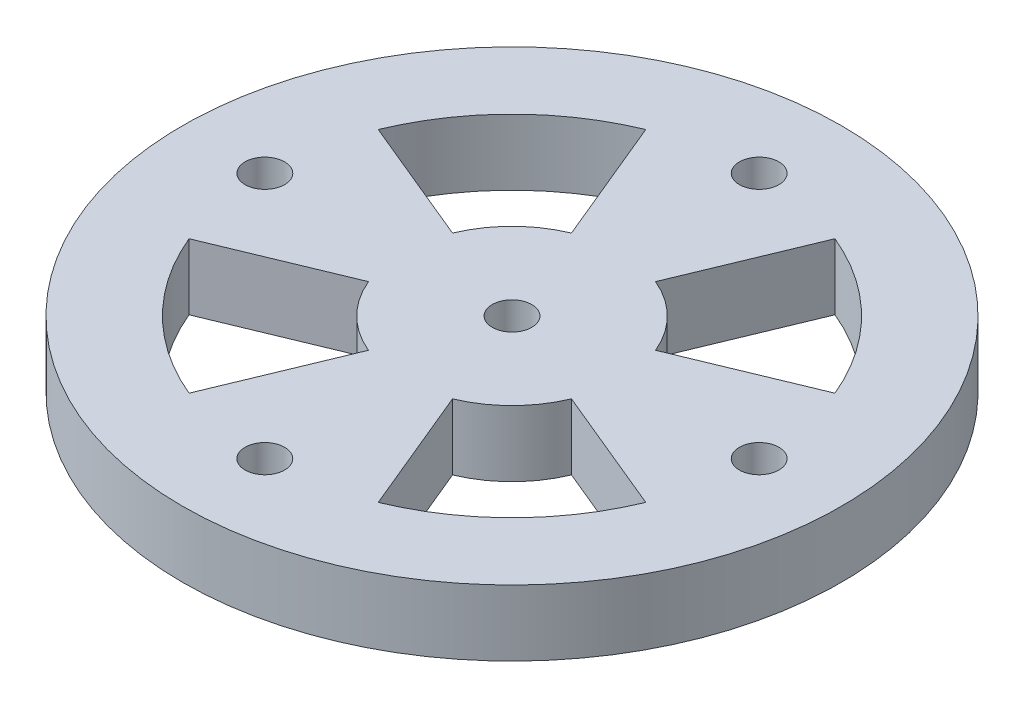
ISO-10303-21;
HEADER;
FILE_DESCRIPTION(('STEP AP214'),'2;1');
FILE_NAME('part.step','',(''),(''),'','','');
FILE_SCHEMA(('AUTOMOTIVE_DESIGN { 1 0 10303 214 1 1 1 1 }'));
ENDSEC;
DATA;
#1=APPLICATION_CONTEXT('core data for automotive mechanical design processes');
#2=APPLICATION_PROTOCOL_DEFINITION('international standard','automotive_design',2000,#1);
#3=PRODUCT_CONTEXT('',#1,'mechanical');
#4=PRODUCT('Part','Part','',(#3));
#5=PRODUCT_RELATED_PRODUCT_CATEGORY('part','',(#4));
#6=PRODUCT_DEFINITION_FORMATION('','',#4);
#7=PRODUCT_DEFINITION_CONTEXT('part definition',#1,'design');
#8=PRODUCT_DEFINITION('design','',#6,#7);
#9=PRODUCT_DEFINITION_SHAPE('','',#8);
#10=(LENGTH_UNIT() NAMED_UNIT(*) SI_UNIT(.MILLI.,.METRE.));
#11=(NAMED_UNIT(*) PLANE_ANGLE_UNIT() SI_UNIT($,.RADIAN.));
#12=(NAMED_UNIT(*) SI_UNIT($,.STERADIAN.) SOLID_ANGLE_UNIT());
#13=UNCERTAINTY_MEASURE_WITH_UNIT(LENGTH_MEASURE(1.E-05),#10,'distance_accuracy_value','');
#14=(GEOMETRIC_REPRESENTATION_CONTEXT(3) GLOBAL_UNCERTAINTY_ASSIGNED_CONTEXT((#13)) GLOBAL_UNIT_ASSIGNED_CONTEXT((#10,
#11,#12)) REPRESENTATION_CONTEXT('',''));
#15=CARTESIAN_POINT('',(0.,0.,0.));
#16=DIRECTION('',(0.,0.,1.));
#17=DIRECTION('',(1.,0.,0.));
#18=AXIS2_PLACEMENT_3D('',#15,#16,#17);
#19=CARTESIAN_POINT('',(0.,5.,0.));
#20=DIRECTION('',(0.923879532511288,0.,0.382683432365087));
#21=DIRECTION('',(0.382683432365087,0.,-0.923879532511288));
#22=AXIS2_PLACEMENT_3D('',#19,#20,#21);
#23=PLANE('',#22);
#24=DIRECTION('',(-0.382683432365087,0.,0.923879532511288));
#25=VECTOR('',#24,1.);
#26=CARTESIAN_POINT('',(0.,0.,0.));
#27=LINE('',#26,#25);
#28=CARTESIAN_POINT('',(-3.18902860304239,0.,7.69899610426073));
#29=VERTEX_POINT('',#28);
#30=CARTESIAN_POINT('',(-7.17531435684538,0.,17.3227412345867));
#31=VERTEX_POINT('',#30);
#32=EDGE_CURVE('E232',#29,#31,#27,.T.);
#33=ORIENTED_EDGE('',*,*,#32,.T.);
#34=DIRECTION('',(0.,-1.,0.));
#35=VECTOR('',#34,1.);
#36=CARTESIAN_POINT('',(-7.17531435684538,5.,17.3227412345867));
#37=LINE('',#36,#35);
#38=CARTESIAN_POINT('',(-7.17531435684538,5.,17.3227412345867));
#39=VERTEX_POINT('',#38);
#40=EDGE_CURVE('E11',#39,#31,#37,.T.);
#41=ORIENTED_EDGE('',*,*,#40,.F.);
#42=DIRECTION('',(-0.382683432365087,0.,0.923879532511288));
#43=VECTOR('',#42,1.);
#44=CARTESIAN_POINT('',(0.,5.,0.));
#45=LINE('',#44,#43);
#46=CARTESIAN_POINT('',(-3.18902860304239,5.,7.69899610426073));
#47=VERTEX_POINT('',#46);
#48=EDGE_CURVE('E161',#47,#39,#45,.T.);
#49=ORIENTED_EDGE('',*,*,#48,.F.);
#50=DIRECTION('',(0.,-1.,0.));
#51=VECTOR('',#50,1.);
#52=CARTESIAN_POINT('',(-3.18902860304239,5.,7.69899610426073));
#53=LINE('',#52,#51);
#54=EDGE_CURVE('E53',#47,#29,#53,.T.);
#55=ORIENTED_EDGE('',*,*,#54,.T.);
#56=EDGE_LOOP('',(#33,#41,#49,#55));
#57=FACE_BOUND('',#56,.T.);
#58=ADVANCED_FACE('F34',(#57),#23,.F.);
#59=CARTESIAN_POINT('',(0.,5.,0.));
#60=DIRECTION('',(0.,-1.,0.));
#61=DIRECTION('',(0.,0.,-1.));
#62=AXIS2_PLACEMENT_3D('',#59,#60,#61);
#63=CYLINDRICAL_SURFACE('',#62,18.75);
#64=CARTESIAN_POINT('',(0.,0.,0.));
#65=DIRECTION('',(0.,1.,0.));
#66=DIRECTION('',(0.,0.,1.));
#67=AXIS2_PLACEMENT_3D('',#64,#65,#66);
#68=CIRCLE('',#67,18.75);
#69=CARTESIAN_POINT('',(-17.3227412345866,0.,7.17531435684546));
#70=VERTEX_POINT('',#69);
#71=EDGE_CURVE('E167',#31,#70,#68,.F.);
#72=ORIENTED_EDGE('',*,*,#71,.T.);
#73=DIRECTION('',(0.,-1.,0.));
#74=VECTOR('',#73,1.);
#75=CARTESIAN_POINT('',(-17.3227412345866,5.,7.17531435684546));
#76=LINE('',#75,#74);
#77=CARTESIAN_POINT('',(-17.3227412345866,5.,7.17531435684546));
#78=VERTEX_POINT('',#77);
#79=EDGE_CURVE('E44',#78,#70,#76,.T.);
#80=ORIENTED_EDGE('',*,*,#79,.F.);
#81=CARTESIAN_POINT('',(0.,5.,0.));
#82=DIRECTION('',(0.,1.,0.));
#83=DIRECTION('',(0.,0.,1.));
#84=AXIS2_PLACEMENT_3D('',#81,#82,#83);
#85=CIRCLE('',#84,18.75);
#86=EDGE_CURVE('E155',#39,#78,#85,.F.);
#87=ORIENTED_EDGE('',*,*,#86,.F.);
#88=ORIENTED_EDGE('',*,*,#40,.T.);
#89=EDGE_LOOP('',(#72,#80,#87,#88));
#90=FACE_BOUND('',#89,.T.);
#91=ADVANCED_FACE('F166',(#90),#63,.F.);
#92=CARTESIAN_POINT('',(0.,5.,0.));
#93=DIRECTION('',(0.382683432365091,0.,0.923879532511287));
#94=DIRECTION('',(0.923879532511287,0.,-0.382683432365091));
#95=AXIS2_PLACEMENT_3D('',#92,#93,#94);
#96=PLANE('',#95);
#97=DIRECTION('',(-0.923879532511287,0.,0.382683432365091));
#98=VECTOR('',#97,1.);
#99=CARTESIAN_POINT('',(0.,0.,0.));
#100=LINE('',#99,#98);
#101=CARTESIAN_POINT('',(-7.69899610426071,0.,3.18902860304243));
#102=VERTEX_POINT('',#101);
#103=EDGE_CURVE('E235',#102,#70,#100,.T.);
#104=ORIENTED_EDGE('',*,*,#103,.F.);
#105=DIRECTION('',(0.,-1.,0.));
#106=VECTOR('',#105,1.);
#107=CARTESIAN_POINT('',(-7.69899610426071,5.,3.18902860304243));
#108=LINE('',#107,#106);
#109=CARTESIAN_POINT('',(-7.69899610426071,5.,3.18902860304243));
#110=VERTEX_POINT('',#109);
#111=EDGE_CURVE('E103',#110,#102,#108,.T.);
#112=ORIENTED_EDGE('',*,*,#111,.F.);
#113=DIRECTION('',(-0.923879532511287,0.,0.382683432365091));
#114=VECTOR('',#113,1.);
#115=CARTESIAN_POINT('',(0.,5.,0.));
#116=LINE('',#115,#114);
#117=EDGE_CURVE('E160',#110,#78,#116,.T.);
#118=ORIENTED_EDGE('',*,*,#117,.T.);
#119=ORIENTED_EDGE('',*,*,#79,.T.);
#120=EDGE_LOOP('',(#104,#112,#118,#119));
#121=FACE_BOUND('',#120,.T.);
#122=ADVANCED_FACE('F171',(#121),#96,.T.);
#123=CARTESIAN_POINT('',(0.,5.,0.));
#124=DIRECTION('',(0.382683432365087,0.,-0.923879532511288));
#125=DIRECTION('',(-0.923879532511288,0.,-0.382683432365087));
#126=AXIS2_PLACEMENT_3D('',#123,#124,#125);
#127=PLANE('',#126);
#128=DIRECTION('',(0.923879532511288,0.,0.382683432365087));
#129=VECTOR('',#128,1.);
#130=CARTESIAN_POINT('',(0.,0.,0.));
#131=LINE('',#130,#129);
#132=CARTESIAN_POINT('',(7.69899610426073,0.,3.18902860304239));
#133=VERTEX_POINT('',#132);
#134=CARTESIAN_POINT('',(17.3227412345867,0.,7.17531435684538));
#135=VERTEX_POINT('',#134);
#136=EDGE_CURVE('E220',#133,#135,#131,.T.);
#137=ORIENTED_EDGE('',*,*,#136,.T.);
#138=DIRECTION('',(0.,-1.,0.));
#139=VECTOR('',#138,1.);
#140=CARTESIAN_POINT('',(17.3227412345867,5.,7.17531435684538));
#141=LINE('',#140,#139);
#142=CARTESIAN_POINT('',(17.3227412345867,5.,7.17531435684538));
#143=VERTEX_POINT('',#142);
#144=EDGE_CURVE('E242',#143,#135,#141,.T.);
#145=ORIENTED_EDGE('',*,*,#144,.F.);
#146=DIRECTION('',(0.923879532511288,0.,0.382683432365087));
#147=VECTOR('',#146,1.);
#148=CARTESIAN_POINT('',(0.,5.,0.));
#149=LINE('',#148,#147);
#150=CARTESIAN_POINT('',(7.69899610426073,5.,3.18902860304239));
#151=VERTEX_POINT('',#150);
#152=EDGE_CURVE('E541',#151,#143,#149,.T.);
#153=ORIENTED_EDGE('',*,*,#152,.F.);
#154=DIRECTION('',(0.,-1.,0.));
#155=VECTOR('',#154,1.);
#156=CARTESIAN_POINT('',(7.69899610426073,5.,3.18902860304239));
#157=LINE('',#156,#155);
#158=EDGE_CURVE('E244',#151,#133,#157,.T.);
#159=ORIENTED_EDGE('',*,*,#158,.T.);
#160=EDGE_LOOP('',(#137,#145,#153,#159));
#161=FACE_BOUND('',#160,.T.);
#162=ADVANCED_FACE('F314',(#161),#127,.F.);
#163=CARTESIAN_POINT('',(0.,5.,0.));
#164=DIRECTION('',(0.,-1.,0.));
#165=DIRECTION('',(0.,0.,-1.));
#166=AXIS2_PLACEMENT_3D('',#163,#164,#165);
#167=CYLINDRICAL_SURFACE('',#166,18.75);
#168=CARTESIAN_POINT('',(0.,0.,0.));
#169=DIRECTION('',(0.,1.,0.));
#170=DIRECTION('',(0.,0.,1.));
#171=AXIS2_PLACEMENT_3D('',#168,#169,#170);
#172=CIRCLE('',#171,18.75);
#173=CARTESIAN_POINT('',(7.17531435684545,0.,17.3227412345866));
#174=VERTEX_POINT('',#173);
#175=EDGE_CURVE('E223',#135,#174,#172,.F.);
#176=ORIENTED_EDGE('',*,*,#175,.T.);
#177=DIRECTION('',(0.,-1.,0.));
#178=VECTOR('',#177,1.);
#179=CARTESIAN_POINT('',(7.17531435684545,5.,17.3227412345866));
#180=LINE('',#179,#178);
#181=CARTESIAN_POINT('',(7.17531435684545,5.,17.3227412345866));
#182=VERTEX_POINT('',#181);
#183=EDGE_CURVE('E249',#182,#174,#180,.T.);
#184=ORIENTED_EDGE('',*,*,#183,.F.);
#185=CARTESIAN_POINT('',(0.,5.,0.));
#186=DIRECTION('',(0.,1.,0.));
#187=DIRECTION('',(0.,0.,1.));
#188=AXIS2_PLACEMENT_3D('',#185,#186,#187);
#189=CIRCLE('',#188,18.75);
#190=EDGE_CURVE('E544',#143,#182,#189,.F.);
#191=ORIENTED_EDGE('',*,*,#190,.F.);
#192=ORIENTED_EDGE('',*,*,#144,.T.);
#193=EDGE_LOOP('',(#176,#184,#191,#192));
#194=FACE_BOUND('',#193,.T.);
#195=ADVANCED_FACE('F310',(#194),#167,.F.);
#196=CARTESIAN_POINT('',(0.,5.,0.));
#197=DIRECTION('',(0.923879532511287,0.,-0.38268343236509));
#198=DIRECTION('',(-0.38268343236509,0.,-0.923879532511287));
#199=AXIS2_PLACEMENT_3D('',#196,#197,#198);
#200=PLANE('',#199);
#201=DIRECTION('',(0.38268343236509,0.,0.923879532511287));
#202=VECTOR('',#201,1.);
#203=CARTESIAN_POINT('',(0.,0.,0.));
#204=LINE('',#203,#202);
#205=CARTESIAN_POINT('',(3.18902860304242,0.,7.69899610426071));
#206=VERTEX_POINT('',#205);
#207=EDGE_CURVE('E226',#206,#174,#204,.T.);
#208=ORIENTED_EDGE('',*,*,#207,.F.);
#209=DIRECTION('',(0.,-1.,0.));
#210=VECTOR('',#209,1.);
#211=CARTESIAN_POINT('',(3.18902860304242,5.,7.69899610426071));
#212=LINE('',#211,#210);
#213=CARTESIAN_POINT('',(3.18902860304242,5.,7.69899610426071));
#214=VERTEX_POINT('',#213);
#215=EDGE_CURVE('E246',#214,#206,#212,.T.);
#216=ORIENTED_EDGE('',*,*,#215,.F.);
#217=DIRECTION('',(0.38268343236509,0.,0.923879532511287));
#218=VECTOR('',#217,1.);
#219=CARTESIAN_POINT('',(0.,5.,0.));
#220=LINE('',#219,#218);
#221=EDGE_CURVE('E552',#214,#182,#220,.T.);
#222=ORIENTED_EDGE('',*,*,#221,.T.);
#223=ORIENTED_EDGE('',*,*,#183,.T.);
#224=EDGE_LOOP('',(#208,#216,#222,#223));
#225=FACE_BOUND('',#224,.T.);
#226=ADVANCED_FACE('F306',(#225),#200,.T.);
#227=CARTESIAN_POINT('',(0.,5.,0.));
#228=DIRECTION('',(-0.923879532511288,0.,-0.382683432365087));
#229=DIRECTION('',(-0.382683432365087,0.,0.923879532511288));
#230=AXIS2_PLACEMENT_3D('',#227,#228,#229);
#231=PLANE('',#230);
#232=DIRECTION('',(0.382683432365087,0.,-0.923879532511288));
#233=VECTOR('',#232,1.);
#234=CARTESIAN_POINT('',(0.,0.,0.));
#235=LINE('',#234,#233);
#236=CARTESIAN_POINT('',(3.18902860304239,0.,-7.69899610426073));
#237=VERTEX_POINT('',#236);
#238=CARTESIAN_POINT('',(7.17531435684538,0.,-17.3227412345867));
#239=VERTEX_POINT('',#238);
#240=EDGE_CURVE('E208',#237,#239,#235,.T.);
#241=ORIENTED_EDGE('',*,*,#240,.T.);
#242=DIRECTION('',(0.,-1.,0.));
#243=VECTOR('',#242,1.);
#244=CARTESIAN_POINT('',(7.17531435684538,5.,-17.3227412345867));
#245=LINE('',#244,#243);
#246=CARTESIAN_POINT('',(7.17531435684538,5.,-17.3227412345867));
#247=VERTEX_POINT('',#246);
#248=EDGE_CURVE('E247',#247,#239,#245,.T.);
#249=ORIENTED_EDGE('',*,*,#248,.F.);
#250=DIRECTION('',(0.382683432365087,0.,-0.923879532511288));
#251=VECTOR('',#250,1.);
#252=CARTESIAN_POINT('',(0.,5.,0.));
#253=LINE('',#252,#251);
#254=CARTESIAN_POINT('',(3.18902860304239,5.,-7.69899610426073));
#255=VERTEX_POINT('',#254);
#256=EDGE_CURVE('E536',#255,#247,#253,.T.);
#257=ORIENTED_EDGE('',*,*,#256,.F.);
#258=DIRECTION('',(0.,-1.,0.));
#259=VECTOR('',#258,1.);
#260=CARTESIAN_POINT('',(3.18902860304239,5.,-7.69899610426073));
#261=LINE('',#260,#259);
#262=EDGE_CURVE('E253',#255,#237,#261,.T.);
#263=ORIENTED_EDGE('',*,*,#262,.T.);
#264=EDGE_LOOP('',(#241,#249,#257,#263));
#265=FACE_BOUND('',#264,.T.);
#266=ADVANCED_FACE('F309',(#265),#231,.F.);
#267=CARTESIAN_POINT('',(0.,5.,0.));
#268=DIRECTION('',(0.,-1.,0.));
#269=DIRECTION('',(0.,0.,-1.));
#270=AXIS2_PLACEMENT_3D('',#267,#268,#269);
#271=CYLINDRICAL_SURFACE('',#270,18.75);
#272=CARTESIAN_POINT('',(0.,0.,0.));
#273=DIRECTION('',(0.,1.,0.));
#274=DIRECTION('',(0.,0.,1.));
#275=AXIS2_PLACEMENT_3D('',#272,#273,#274);
#276=CIRCLE('',#275,18.75);
#277=CARTESIAN_POINT('',(17.3227412345866,0.,-7.17531435684545));
#278=VERTEX_POINT('',#277);
#279=EDGE_CURVE('E211',#239,#278,#276,.F.);
#280=ORIENTED_EDGE('',*,*,#279,.T.);
#281=DIRECTION('',(0.,-1.,0.));
#282=VECTOR('',#281,1.);
#283=CARTESIAN_POINT('',(17.3227412345866,5.,-7.17531435684545));
#284=LINE('',#283,#282);
#285=CARTESIAN_POINT('',(17.3227412345866,5.,-7.17531435684545));
#286=VERTEX_POINT('',#285);
#287=EDGE_CURVE('E257',#286,#278,#284,.T.);
#288=ORIENTED_EDGE('',*,*,#287,.F.);
#289=CARTESIAN_POINT('',(0.,5.,0.));
#290=DIRECTION('',(0.,1.,0.));
#291=DIRECTION('',(0.,0.,1.));
#292=AXIS2_PLACEMENT_3D('',#289,#290,#291);
#293=CIRCLE('',#292,18.75);
#294=EDGE_CURVE('E566',#247,#286,#293,.F.);
#295=ORIENTED_EDGE('',*,*,#294,.F.);
#296=ORIENTED_EDGE('',*,*,#248,.T.);
#297=EDGE_LOOP('',(#280,#288,#295,#296));
#298=FACE_BOUND('',#297,.T.);
#299=ADVANCED_FACE('F326',(#298),#271,.F.);
#300=CARTESIAN_POINT('',(0.,5.,0.));
#301=DIRECTION('',(-0.38268343236509,0.,-0.923879532511287));
#302=DIRECTION('',(-0.923879532511287,0.,0.38268343236509));
#303=AXIS2_PLACEMENT_3D('',#300,#301,#302);
#304=PLANE('',#303);
#305=DIRECTION('',(0.923879532511287,0.,-0.38268343236509));
#306=VECTOR('',#305,1.);
#307=CARTESIAN_POINT('',(0.,0.,0.));
#308=LINE('',#307,#306);
#309=CARTESIAN_POINT('',(7.69899610426072,0.,-3.18902860304242));
#310=VERTEX_POINT('',#309);
#311=EDGE_CURVE('E214',#310,#278,#308,.T.);
#312=ORIENTED_EDGE('',*,*,#311,.F.);
#313=DIRECTION('',(0.,-1.,0.));
#314=VECTOR('',#313,1.);
#315=CARTESIAN_POINT('',(7.69899610426072,5.,-3.18902860304242));
#316=LINE('',#315,#314);
#317=CARTESIAN_POINT('',(7.69899610426072,5.,-3.18902860304242));
#318=VERTEX_POINT('',#317);
#319=EDGE_CURVE('E255',#318,#310,#316,.T.);
#320=ORIENTED_EDGE('',*,*,#319,.F.);
#321=DIRECTION('',(0.923879532511287,0.,-0.38268343236509));
#322=VECTOR('',#321,1.);
#323=CARTESIAN_POINT('',(0.,5.,0.));
#324=LINE('',#323,#322);
#325=EDGE_CURVE('E563',#318,#286,#324,.T.);
#326=ORIENTED_EDGE('',*,*,#325,.T.);
#327=ORIENTED_EDGE('',*,*,#287,.T.);
#328=EDGE_LOOP('',(#312,#320,#326,#327));
#329=FACE_BOUND('',#328,.T.);
#330=ADVANCED_FACE('F323',(#329),#304,.T.);
#331=CARTESIAN_POINT('',(0.,5.,0.));
#332=DIRECTION('',(0.,-1.,0.));
#333=DIRECTION('',(0.,0.,-1.));
#334=AXIS2_PLACEMENT_3D('',#331,#332,#333);
#335=CYLINDRICAL_SURFACE('',#334,8.33333333333333);
#336=CARTESIAN_POINT('',(0.,0.,0.));
#337=DIRECTION('',(0.,1.,0.));
#338=DIRECTION('',(0.,0.,1.));
#339=AXIS2_PLACEMENT_3D('',#336,#337,#338);
#340=CIRCLE('',#339,8.33333333333333);
#341=CARTESIAN_POINT('',(-7.69899610426073,0.,-3.18902860304239));
#342=VERTEX_POINT('',#341);
#343=CARTESIAN_POINT('',(-3.18902860304242,0.,-7.69899610426072));
#344=VERTEX_POINT('',#343);
#345=EDGE_CURVE('E181',#342,#344,#340,.F.);
#346=ORIENTED_EDGE('',*,*,#345,.F.);
#347=DIRECTION('',(0.,-1.,0.));
#348=VECTOR('',#347,1.);
#349=CARTESIAN_POINT('',(-7.69899610426073,5.,-3.18902860304239));
#350=LINE('',#349,#348);
#351=CARTESIAN_POINT('',(-7.69899610426073,5.,-3.18902860304239));
#352=VERTEX_POINT('',#351);
#353=EDGE_CURVE('E38',#352,#342,#350,.T.);
#354=ORIENTED_EDGE('',*,*,#353,.F.);
#355=CARTESIAN_POINT('',(0.,5.,0.));
#356=DIRECTION('',(0.,1.,0.));
#357=DIRECTION('',(0.,0.,1.));
#358=AXIS2_PLACEMENT_3D('',#355,#356,#357);
#359=CIRCLE('',#358,8.33333333333333);
#360=CARTESIAN_POINT('',(-3.18902860304242,5.,-7.69899610426072));
#361=VERTEX_POINT('',#360);
#362=EDGE_CURVE('E278',#352,#361,#359,.F.);
#363=ORIENTED_EDGE('',*,*,#362,.T.);
#364=DIRECTION('',(0.,-1.,0.));
#365=VECTOR('',#364,1.);
#366=CARTESIAN_POINT('',(-3.18902860304242,5.,-7.69899610426072));
#367=LINE('',#366,#365);
#368=EDGE_CURVE('E174',#361,#344,#367,.T.);
#369=ORIENTED_EDGE('',*,*,#368,.T.);
#370=EDGE_LOOP('',(#346,#354,#363,#369));
#371=FACE_BOUND('',#370,.T.);
#372=ADVANCED_FACE('F277',(#371),#335,.T.);
#373=CARTESIAN_POINT('',(0.,5.,0.));
#374=DIRECTION('',(-0.382683432365087,0.,0.923879532511288));
#375=DIRECTION('',(0.923879532511288,0.,0.382683432365087));
#376=AXIS2_PLACEMENT_3D('',#373,#374,#375);
#377=PLANE('',#376);
#378=DIRECTION('',(-0.923879532511288,0.,-0.382683432365087));
#379=VECTOR('',#378,1.);
#380=CARTESIAN_POINT('',(0.,0.,0.));
#381=LINE('',#380,#379);
#382=CARTESIAN_POINT('',(-17.3227412345867,0.,-7.17531435684539));
#383=VERTEX_POINT('',#382);
#384=EDGE_CURVE('E184',#342,#383,#381,.T.);
#385=ORIENTED_EDGE('',*,*,#384,.T.);
#386=DIRECTION('',(0.,-1.,0.));
#387=VECTOR('',#386,1.);
#388=CARTESIAN_POINT('',(-17.3227412345867,5.,-7.17531435684539));
#389=LINE('',#388,#387);
#390=CARTESIAN_POINT('',(-17.3227412345867,5.,-7.17531435684539));
#391=VERTEX_POINT('',#390);
#392=EDGE_CURVE('E263',#391,#383,#389,.T.);
#393=ORIENTED_EDGE('',*,*,#392,.F.);
#394=DIRECTION('',(-0.923879532511288,0.,-0.382683432365087));
#395=VECTOR('',#394,1.);
#396=CARTESIAN_POINT('',(0.,5.,0.));
#397=LINE('',#396,#395);
#398=EDGE_CURVE('E271',#352,#391,#397,.T.);
#399=ORIENTED_EDGE('',*,*,#398,.F.);
#400=ORIENTED_EDGE('',*,*,#353,.T.);
#401=EDGE_LOOP('',(#385,#393,#399,#400));
#402=FACE_BOUND('',#401,.T.);
#403=ADVANCED_FACE('F269',(#402),#377,.F.);
#404=CARTESIAN_POINT('',(0.,5.,0.));
#405=DIRECTION('',(0.,-1.,0.));
#406=DIRECTION('',(0.,0.,-1.));
#407=AXIS2_PLACEMENT_3D('',#404,#405,#406);
#408=CYLINDRICAL_SURFACE('',#407,18.75);
#409=CARTESIAN_POINT('',(0.,0.,0.));
#410=DIRECTION('',(0.,1.,0.));
#411=DIRECTION('',(0.,0.,1.));
#412=AXIS2_PLACEMENT_3D('',#409,#410,#411);
#413=CIRCLE('',#412,18.75);
#414=CARTESIAN_POINT('',(-7.17531435684545,0.,-17.3227412345866));
#415=VERTEX_POINT('',#414);
#416=EDGE_CURVE('E187',#383,#415,#413,.F.);
#417=ORIENTED_EDGE('',*,*,#416,.T.);
#418=DIRECTION('',(0.,-1.,0.));
#419=VECTOR('',#418,1.);
#420=CARTESIAN_POINT('',(-7.17531435684545,5.,-17.3227412345866));
#421=LINE('',#420,#419);
#422=CARTESIAN_POINT('',(-7.17531435684545,5.,-17.3227412345866));
#423=VERTEX_POINT('',#422);
#424=EDGE_CURVE('E262',#423,#415,#421,.T.);
#425=ORIENTED_EDGE('',*,*,#424,.F.);
#426=CARTESIAN_POINT('',(0.,5.,0.));
#427=DIRECTION('',(0.,1.,0.));
#428=DIRECTION('',(0.,0.,1.));
#429=AXIS2_PLACEMENT_3D('',#426,#427,#428);
#430=CIRCLE('',#429,18.75);
#431=EDGE_CURVE('E575',#391,#423,#430,.F.);
#432=ORIENTED_EDGE('',*,*,#431,.F.);
#433=ORIENTED_EDGE('',*,*,#392,.T.);
#434=EDGE_LOOP('',(#417,#425,#432,#433));
#435=FACE_BOUND('',#434,.T.);
#436=ADVANCED_FACE('F285',(#435),#408,.F.);
#437=CARTESIAN_POINT('',(0.,5.,0.));
#438=DIRECTION('',(0.,-1.,0.));
#439=DIRECTION('',(0.,0.,-1.));
#440=AXIS2_PLACEMENT_3D('',#437,#438,#439);
#441=CYLINDRICAL_SURFACE('',#440,8.33333333333333);
#442=CARTESIAN_POINT('',(0.,0.,0.));
#443=DIRECTION('',(0.,1.,0.));
#444=DIRECTION('',(0.,0.,1.));
#445=AXIS2_PLACEMENT_3D('',#442,#443,#444);
#446=CIRCLE('',#445,8.33333333333333);
#447=EDGE_CURVE('E229',#133,#206,#446,.F.);
#448=ORIENTED_EDGE('',*,*,#447,.F.);
#449=ORIENTED_EDGE('',*,*,#158,.F.);
#450=CARTESIAN_POINT('',(0.,5.,0.));
#451=DIRECTION('',(0.,1.,0.));
#452=DIRECTION('',(0.,0.,1.));
#453=AXIS2_PLACEMENT_3D('',#450,#451,#452);
#454=CIRCLE('',#453,8.33333333333333);
#455=EDGE_CURVE('E547',#151,#214,#454,.F.);
#456=ORIENTED_EDGE('',*,*,#455,.T.);
#457=ORIENTED_EDGE('',*,*,#215,.T.);
#458=EDGE_LOOP('',(#448,#449,#456,#457));
#459=FACE_BOUND('',#458,.T.);
#460=ADVANCED_FACE('F287',(#459),#441,.T.);
#461=CARTESIAN_POINT('',(0.,5.,0.));
#462=DIRECTION('',(0.,-1.,0.));
#463=DIRECTION('',(0.,0.,-1.));
#464=AXIS2_PLACEMENT_3D('',#461,#462,#463);
#465=CYLINDRICAL_SURFACE('',#464,8.33333333333333);
#466=CARTESIAN_POINT('',(0.,0.,0.));
#467=DIRECTION('',(0.,1.,0.));
#468=DIRECTION('',(0.,0.,1.));
#469=AXIS2_PLACEMENT_3D('',#466,#467,#468);
#470=CIRCLE('',#469,8.33333333333333);
#471=EDGE_CURVE('E217',#237,#310,#470,.F.);
#472=ORIENTED_EDGE('',*,*,#471,.F.);
#473=ORIENTED_EDGE('',*,*,#262,.F.);
#474=CARTESIAN_POINT('',(0.,5.,0.));
#475=DIRECTION('',(0.,1.,0.));
#476=DIRECTION('',(0.,0.,1.));
#477=AXIS2_PLACEMENT_3D('',#474,#475,#476);
#478=CIRCLE('',#477,8.33333333333333);
#479=EDGE_CURVE('E548',#255,#318,#478,.F.);
#480=ORIENTED_EDGE('',*,*,#479,.T.);
#481=ORIENTED_EDGE('',*,*,#319,.T.);
#482=EDGE_LOOP('',(#472,#473,#480,#481));
#483=FACE_BOUND('',#482,.T.);
#484=ADVANCED_FACE('F293',(#483),#465,.T.);
#485=CARTESIAN_POINT('',(0.,5.,0.));
#486=DIRECTION('',(0.,-1.,0.));
#487=DIRECTION('',(0.,0.,-1.));
#488=AXIS2_PLACEMENT_3D('',#485,#486,#487);
#489=CYLINDRICAL_SURFACE('',#488,25.);
#490=CARTESIAN_POINT('',(0.,5.,0.));
#491=DIRECTION('',(0.,1.,0.));
#492=DIRECTION('',(0.,0.,1.));
#493=AXIS2_PLACEMENT_3D('',#490,#491,#492);
#494=CIRCLE('',#493,25.);
#495=CARTESIAN_POINT('',(0.,5.,25.));
#496=VERTEX_POINT('',#495);
#497=EDGE_CURVE('E531',#496,#496,#494,.T.);
#498=ORIENTED_EDGE('',*,*,#497,.F.);
#499=EDGE_LOOP('',(#498));
#500=FACE_BOUND('',#499,.T.);
#501=CARTESIAN_POINT('',(0.,0.,0.));
#502=DIRECTION('',(0.,1.,0.));
#503=DIRECTION('',(0.,0.,1.));
#504=AXIS2_PLACEMENT_3D('',#501,#502,#503);
#505=CIRCLE('',#504,25.);
#506=CARTESIAN_POINT('',(0.,0.,25.));
#507=VERTEX_POINT('',#506);
#508=EDGE_CURVE('E205',#507,#507,#505,.T.);
#509=ORIENTED_EDGE('',*,*,#508,.T.);
#510=EDGE_LOOP('',(#509));
#511=FACE_BOUND('',#510,.T.);
#512=ADVANCED_FACE('F321',(#500,#511),#489,.T.);
#513=CARTESIAN_POINT('',(0.,5.,0.));
#514=DIRECTION('',(0.,-1.,0.));
#515=DIRECTION('',(0.,0.,-1.));
#516=AXIS2_PLACEMENT_3D('',#513,#514,#515);
#517=CYLINDRICAL_SURFACE('',#516,1.5);
#518=CARTESIAN_POINT('',(0.,5.,0.));
#519=DIRECTION('',(0.,1.,0.));
#520=DIRECTION('',(0.,0.,1.));
#521=AXIS2_PLACEMENT_3D('',#518,#519,#520);
#522=CIRCLE('',#521,1.5);
#523=CARTESIAN_POINT('',(0.,5.,1.5));
#524=VERTEX_POINT('',#523);
#525=EDGE_CURVE('E527',#524,#524,#522,.T.);
#526=ORIENTED_EDGE('',*,*,#525,.T.);
#527=EDGE_LOOP('',(#526));
#528=FACE_BOUND('',#527,.T.);
#529=CARTESIAN_POINT('',(0.,0.,0.));
#530=DIRECTION('',(0.,1.,0.));
#531=DIRECTION('',(0.,0.,1.));
#532=AXIS2_PLACEMENT_3D('',#529,#530,#531);
#533=CIRCLE('',#532,1.5);
#534=CARTESIAN_POINT('',(0.,0.,1.5));
#535=VERTEX_POINT('',#534);
#536=EDGE_CURVE('E202',#535,#535,#533,.T.);
#537=ORIENTED_EDGE('',*,*,#536,.F.);
#538=EDGE_LOOP('',(#537));
#539=FACE_BOUND('',#538,.T.);
#540=ADVANCED_FACE('F336',(#528,#539),#517,.F.);
#541=CARTESIAN_POINT('',(18.75,5.,0.));
#542=DIRECTION('',(0.,-1.,0.));
#543=DIRECTION('',(0.,0.,-1.));
#544=AXIS2_PLACEMENT_3D('',#541,#542,#543);
#545=CYLINDRICAL_SURFACE('',#544,1.5);
#546=CARTESIAN_POINT('',(18.75,5.,0.));
#547=DIRECTION('',(0.,1.,0.));
#548=DIRECTION('',(0.,0.,1.));
#549=AXIS2_PLACEMENT_3D('',#546,#547,#548);
#550=CIRCLE('',#549,1.5);
#551=CARTESIAN_POINT('',(18.75,5.,1.5));
#552=VERTEX_POINT('',#551);
#553=EDGE_CURVE('E523',#552,#552,#550,.T.);
#554=ORIENTED_EDGE('',*,*,#553,.T.);
#555=EDGE_LOOP('',(#554));
#556=FACE_BOUND('',#555,.T.);
#557=CARTESIAN_POINT('',(18.75,0.,0.));
#558=DIRECTION('',(0.,1.,0.));
#559=DIRECTION('',(0.,0.,1.));
#560=AXIS2_PLACEMENT_3D('',#557,#558,#559);
#561=CIRCLE('',#560,1.5);
#562=CARTESIAN_POINT('',(18.75,0.,1.5));
#563=VERTEX_POINT('',#562);
#564=EDGE_CURVE('E199',#563,#563,#561,.T.);
#565=ORIENTED_EDGE('',*,*,#564,.F.);
#566=EDGE_LOOP('',(#565));
#567=FACE_BOUND('',#566,.T.);
#568=ADVANCED_FACE('F340',(#556,#567),#545,.F.);
#569=CARTESIAN_POINT('',(0.,5.,18.75));
#570=DIRECTION('',(0.,-1.,0.));
#571=DIRECTION('',(0.,0.,-1.));
#572=AXIS2_PLACEMENT_3D('',#569,#570,#571);
#573=CYLINDRICAL_SURFACE('',#572,1.5);
#574=CARTESIAN_POINT('',(0.,5.,18.75));
#575=DIRECTION('',(0.,1.,0.));
#576=DIRECTION('',(0.,0.,1.));
#577=AXIS2_PLACEMENT_3D('',#574,#575,#576);
#578=CIRCLE('',#577,1.5);
#579=CARTESIAN_POINT('',(0.,5.,20.25));
#580=VERTEX_POINT('',#579);
#581=EDGE_CURVE('E519',#580,#580,#578,.T.);
#582=ORIENTED_EDGE('',*,*,#581,.T.);
#583=EDGE_LOOP('',(#582));
#584=FACE_BOUND('',#583,.T.);
#585=CARTESIAN_POINT('',(0.,0.,18.75));
#586=DIRECTION('',(0.,1.,0.));
#587=DIRECTION('',(0.,0.,1.));
#588=AXIS2_PLACEMENT_3D('',#585,#586,#587);
#589=CIRCLE('',#588,1.5);
#590=CARTESIAN_POINT('',(0.,0.,20.25));
#591=VERTEX_POINT('',#590);
#592=EDGE_CURVE('E196',#591,#591,#589,.T.);
#593=ORIENTED_EDGE('',*,*,#592,.F.);
#594=EDGE_LOOP('',(#593));
#595=FACE_BOUND('',#594,.T.);
#596=ADVANCED_FACE('F344',(#584,#595),#573,.F.);
#597=CARTESIAN_POINT('',(-18.75,5.,0.));
#598=DIRECTION('',(0.,-1.,0.));
#599=DIRECTION('',(0.,0.,-1.));
#600=AXIS2_PLACEMENT_3D('',#597,#598,#599);
#601=CYLINDRICAL_SURFACE('',#600,1.5);
#602=CARTESIAN_POINT('',(-18.75,5.,0.));
#603=DIRECTION('',(0.,1.,0.));
#604=DIRECTION('',(0.,0.,1.));
#605=AXIS2_PLACEMENT_3D('',#602,#603,#604);
#606=CIRCLE('',#605,1.5);
#607=CARTESIAN_POINT('',(-18.75,5.,1.50000000000001));
#608=VERTEX_POINT('',#607);
#609=EDGE_CURVE('E515',#608,#608,#606,.T.);
#610=ORIENTED_EDGE('',*,*,#609,.T.);
#611=EDGE_LOOP('',(#610));
#612=FACE_BOUND('',#611,.T.);
#613=CARTESIAN_POINT('',(-18.75,0.,0.));
#614=DIRECTION('',(0.,1.,0.));
#615=DIRECTION('',(0.,0.,1.));
#616=AXIS2_PLACEMENT_3D('',#613,#614,#615);
#617=CIRCLE('',#616,1.5);
#618=CARTESIAN_POINT('',(-18.75,0.,1.50000000000001));
#619=VERTEX_POINT('',#618);
#620=EDGE_CURVE('E193',#619,#619,#617,.T.);
#621=ORIENTED_EDGE('',*,*,#620,.F.);
#622=EDGE_LOOP('',(#621));
#623=FACE_BOUND('',#622,.T.);
#624=ADVANCED_FACE('F348',(#612,#623),#601,.F.);
#625=CARTESIAN_POINT('',(0.,5.,0.));
#626=DIRECTION('',(-0.923879532511287,0.,0.38268343236509));
#627=DIRECTION('',(0.38268343236509,0.,0.923879532511287));
#628=AXIS2_PLACEMENT_3D('',#625,#626,#627);
#629=PLANE('',#628);
#630=DIRECTION('',(-0.38268343236509,0.,-0.923879532511287));
#631=VECTOR('',#630,1.);
#632=CARTESIAN_POINT('',(0.,0.,0.));
#633=LINE('',#632,#631);
#634=EDGE_CURVE('E190',#344,#415,#633,.T.);
#635=ORIENTED_EDGE('',*,*,#634,.F.);
#636=ORIENTED_EDGE('',*,*,#368,.F.);
#637=DIRECTION('',(-0.38268343236509,0.,-0.923879532511287));
#638=VECTOR('',#637,1.);
#639=CARTESIAN_POINT('',(0.,5.,0.));
#640=LINE('',#639,#638);
#641=EDGE_CURVE('E283',#361,#423,#640,.T.);
#642=ORIENTED_EDGE('',*,*,#641,.T.);
#643=ORIENTED_EDGE('',*,*,#424,.T.);
#644=EDGE_LOOP('',(#635,#636,#642,#643));
#645=FACE_BOUND('',#644,.T.);
#646=ADVANCED_FACE('F282',(#645),#629,.T.);
#647=CARTESIAN_POINT('',(0.,5.,-18.75));
#648=DIRECTION('',(0.,-1.,0.));
#649=DIRECTION('',(0.,0.,-1.));
#650=AXIS2_PLACEMENT_3D('',#647,#648,#649);
#651=CYLINDRICAL_SURFACE('',#650,1.5);
#652=CARTESIAN_POINT('',(0.,5.,-18.75));
#653=DIRECTION('',(0.,1.,0.));
#654=DIRECTION('',(0.,0.,1.));
#655=AXIS2_PLACEMENT_3D('',#652,#653,#654);
#656=CIRCLE('',#655,1.5);
#657=CARTESIAN_POINT('',(0.,5.,-17.25));
#658=VERTEX_POINT('',#657);
#659=EDGE_CURVE('E240',#658,#658,#656,.T.);
#660=ORIENTED_EDGE('',*,*,#659,.T.);
#661=EDGE_LOOP('',(#660));
#662=FACE_BOUND('',#661,.T.);
#663=CARTESIAN_POINT('',(0.,0.,-18.75));
#664=DIRECTION('',(0.,1.,0.));
#665=DIRECTION('',(0.,0.,1.));
#666=AXIS2_PLACEMENT_3D('',#663,#664,#665);
#667=CIRCLE('',#666,1.5);
#668=CARTESIAN_POINT('',(0.,0.,-17.25));
#669=VERTEX_POINT('',#668);
#670=EDGE_CURVE('E178',#669,#669,#667,.T.);
#671=ORIENTED_EDGE('',*,*,#670,.F.);
#672=EDGE_LOOP('',(#671));
#673=FACE_BOUND('',#672,.T.);
#674=ADVANCED_FACE('F36',(#662,#673),#651,.F.);
#675=CARTESIAN_POINT('',(0.,5.,0.));
#676=DIRECTION('',(0.,-1.,0.));
#677=DIRECTION('',(0.,0.,-1.));
#678=AXIS2_PLACEMENT_3D('',#675,#676,#677);
#679=CYLINDRICAL_SURFACE('',#678,8.33333333333333);
#680=CARTESIAN_POINT('',(0.,0.,0.));
#681=DIRECTION('',(0.,1.,0.));
#682=DIRECTION('',(0.,0.,1.));
#683=AXIS2_PLACEMENT_3D('',#680,#681,#682);
#684=CIRCLE('',#683,8.33333333333333);
#685=EDGE_CURVE('E237',#29,#102,#684,.F.);
#686=ORIENTED_EDGE('',*,*,#685,.F.);
#687=ORIENTED_EDGE('',*,*,#54,.F.);
#688=CARTESIAN_POINT('',(0.,5.,0.));
#689=DIRECTION('',(0.,1.,0.));
#690=DIRECTION('',(0.,0.,1.));
#691=AXIS2_PLACEMENT_3D('',#688,#689,#690);
#692=CIRCLE('',#691,8.33333333333333);
#693=EDGE_CURVE('E172',#47,#110,#692,.F.);
#694=ORIENTED_EDGE('',*,*,#693,.T.);
#695=ORIENTED_EDGE('',*,*,#111,.T.);
#696=EDGE_LOOP('',(#686,#687,#694,#695));
#697=FACE_BOUND('',#696,.T.);
#698=ADVANCED_FACE('F356',(#697),#679,.T.);
#699=CARTESIAN_POINT('',(0.,5.,0.));
#700=DIRECTION('',(0.,1.,0.));
#701=DIRECTION('',(0.,0.,1.));
#702=AXIS2_PLACEMENT_3D('',#699,#700,#701);
#703=PLANE('',#702);
#704=ORIENTED_EDGE('',*,*,#659,.F.);
#705=EDGE_LOOP('',(#704));
#706=FACE_BOUND('',#705,.T.);
#707=ORIENTED_EDGE('',*,*,#362,.F.);
#708=ORIENTED_EDGE('',*,*,#398,.T.);
#709=ORIENTED_EDGE('',*,*,#431,.T.);
#710=ORIENTED_EDGE('',*,*,#641,.F.);
#711=EDGE_LOOP('',(#707,#708,#709,#710));
#712=FACE_BOUND('',#711,.T.);
#713=ORIENTED_EDGE('',*,*,#609,.F.);
#714=EDGE_LOOP('',(#713));
#715=FACE_BOUND('',#714,.T.);
#716=ORIENTED_EDGE('',*,*,#581,.F.);
#717=EDGE_LOOP('',(#716));
#718=FACE_BOUND('',#717,.T.);
#719=ORIENTED_EDGE('',*,*,#553,.F.);
#720=EDGE_LOOP('',(#719));
#721=FACE_BOUND('',#720,.T.);
#722=ORIENTED_EDGE('',*,*,#525,.F.);
#723=EDGE_LOOP('',(#722));
#724=FACE_BOUND('',#723,.T.);
#725=ORIENTED_EDGE('',*,*,#497,.T.);
#726=EDGE_LOOP('',(#725));
#727=FACE_BOUND('',#726,.T.);
#728=ORIENTED_EDGE('',*,*,#256,.T.);
#729=ORIENTED_EDGE('',*,*,#294,.T.);
#730=ORIENTED_EDGE('',*,*,#325,.F.);
#731=ORIENTED_EDGE('',*,*,#479,.F.);
#732=EDGE_LOOP('',(#728,#729,#730,#731));
#733=FACE_BOUND('',#732,.T.);
#734=ORIENTED_EDGE('',*,*,#152,.T.);
#735=ORIENTED_EDGE('',*,*,#190,.T.);
#736=ORIENTED_EDGE('',*,*,#221,.F.);
#737=ORIENTED_EDGE('',*,*,#455,.F.);
#738=EDGE_LOOP('',(#734,#735,#736,#737));
#739=FACE_BOUND('',#738,.T.);
#740=ORIENTED_EDGE('',*,*,#48,.T.);
#741=ORIENTED_EDGE('',*,*,#86,.T.);
#742=ORIENTED_EDGE('',*,*,#117,.F.);
#743=ORIENTED_EDGE('',*,*,#693,.F.);
#744=EDGE_LOOP('',(#740,#741,#742,#743));
#745=FACE_BOUND('',#744,.T.);
#746=ADVANCED_FACE('F157',(#706,#712,#715,#718,#721,#724,#727,#733,#739,#745),#703,.T.);
#747=CARTESIAN_POINT('',(0.,0.,0.));
#748=DIRECTION('',(0.,1.,0.));
#749=DIRECTION('',(0.,0.,1.));
#750=AXIS2_PLACEMENT_3D('',#747,#748,#749);
#751=PLANE('',#750);
#752=ORIENTED_EDGE('',*,*,#670,.T.);
#753=EDGE_LOOP('',(#752));
#754=FACE_BOUND('',#753,.T.);
#755=ORIENTED_EDGE('',*,*,#345,.T.);
#756=ORIENTED_EDGE('',*,*,#634,.T.);
#757=ORIENTED_EDGE('',*,*,#416,.F.);
#758=ORIENTED_EDGE('',*,*,#384,.F.);
#759=EDGE_LOOP('',(#755,#756,#757,#758));
#760=FACE_BOUND('',#759,.T.);
#761=ORIENTED_EDGE('',*,*,#620,.T.);
#762=EDGE_LOOP('',(#761));
#763=FACE_BOUND('',#762,.T.);
#764=ORIENTED_EDGE('',*,*,#592,.T.);
#765=EDGE_LOOP('',(#764));
#766=FACE_BOUND('',#765,.T.);
#767=ORIENTED_EDGE('',*,*,#564,.T.);
#768=EDGE_LOOP('',(#767));
#769=FACE_BOUND('',#768,.T.);
#770=ORIENTED_EDGE('',*,*,#536,.T.);
#771=EDGE_LOOP('',(#770));
#772=FACE_BOUND('',#771,.T.);
#773=ORIENTED_EDGE('',*,*,#508,.F.);
#774=EDGE_LOOP('',(#773));
#775=FACE_BOUND('',#774,.T.);
#776=ORIENTED_EDGE('',*,*,#240,.F.);
#777=ORIENTED_EDGE('',*,*,#471,.T.);
#778=ORIENTED_EDGE('',*,*,#311,.T.);
#779=ORIENTED_EDGE('',*,*,#279,.F.);
#780=EDGE_LOOP('',(#776,#777,#778,#779));
#781=FACE_BOUND('',#780,.T.);
#782=ORIENTED_EDGE('',*,*,#136,.F.);
#783=ORIENTED_EDGE('',*,*,#447,.T.);
#784=ORIENTED_EDGE('',*,*,#207,.T.);
#785=ORIENTED_EDGE('',*,*,#175,.F.);
#786=EDGE_LOOP('',(#782,#783,#784,#785));
#787=FACE_BOUND('',#786,.T.);
#788=ORIENTED_EDGE('',*,*,#32,.F.);
#789=ORIENTED_EDGE('',*,*,#685,.T.);
#790=ORIENTED_EDGE('',*,*,#103,.T.);
#791=ORIENTED_EDGE('',*,*,#71,.F.);
#792=EDGE_LOOP('',(#788,#789,#790,#791));
#793=FACE_BOUND('',#792,.T.);
#794=ADVANCED_FACE('F274',(#754,#760,#763,#766,#769,#772,#775,#781,#787,#793),#751,.F.);
#795=CLOSED_SHELL('',(#58,#91,#122,#162,#195,#226,#266,#299,#330,#372,#403,#436,#460,#484,#512,
#540,#568,#596,#624,#646,#674,#698,#746,#794));
#796=MANIFOLD_SOLID_BREP('B2',#795);
#797=ADVANCED_BREP_SHAPE_REPRESENTATION('',(#18,#796),#14);
#798=SHAPE_DEFINITION_REPRESENTATION(#9,#797);
ENDSEC;
END-ISO-10303-21;
